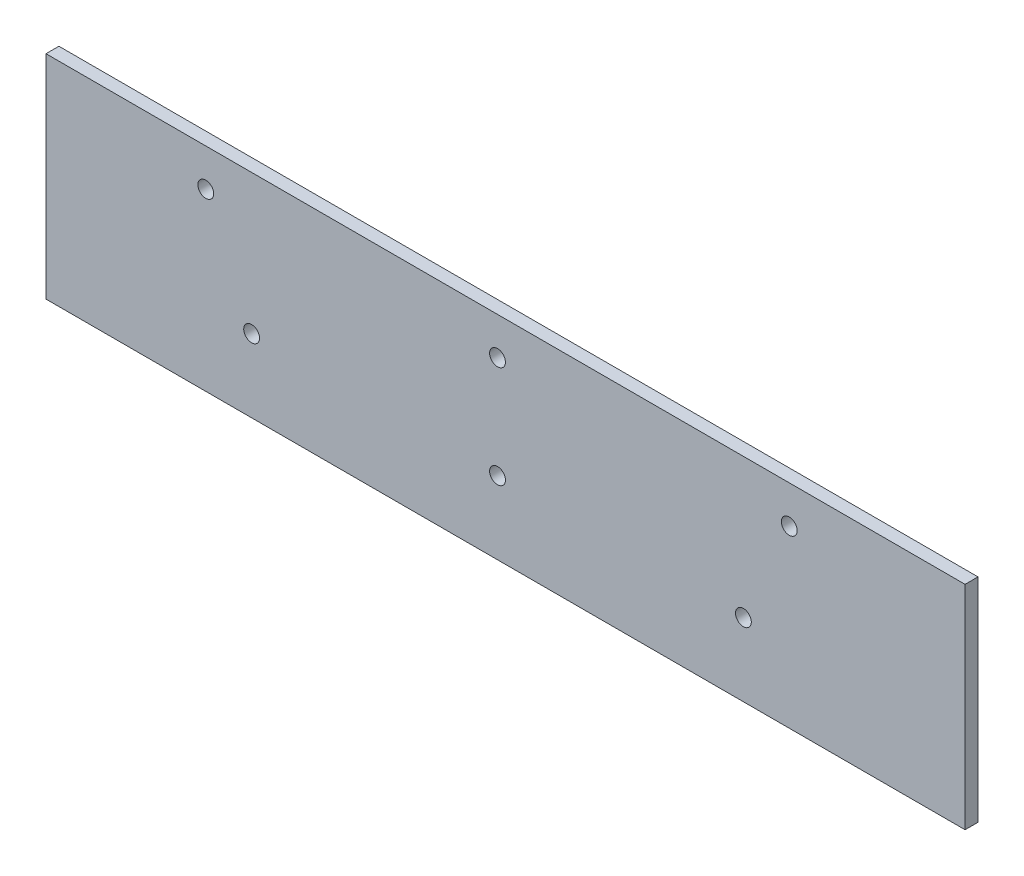
ISO-10303-21;
HEADER;
FILE_DESCRIPTION(('STEP AP214'),'2;1');
FILE_NAME('part.step','',(''),(''),'','','');
FILE_SCHEMA(('AUTOMOTIVE_DESIGN { 1 0 10303 214 1 1 1 1 }'));
ENDSEC;
DATA;
#1=APPLICATION_CONTEXT('core data for automotive mechanical design processes');
#2=APPLICATION_PROTOCOL_DEFINITION('international standard','automotive_design',2000,#1);
#3=PRODUCT_CONTEXT('',#1,'mechanical');
#4=PRODUCT('Part','Part','',(#3));
#5=PRODUCT_RELATED_PRODUCT_CATEGORY('part','',(#4));
#6=PRODUCT_DEFINITION_FORMATION('','',#4);
#7=PRODUCT_DEFINITION_CONTEXT('part definition',#1,'design');
#8=PRODUCT_DEFINITION('design','',#6,#7);
#9=PRODUCT_DEFINITION_SHAPE('','',#8);
#10=(LENGTH_UNIT() NAMED_UNIT(*) SI_UNIT(.MILLI.,.METRE.));
#11=(NAMED_UNIT(*) PLANE_ANGLE_UNIT() SI_UNIT($,.RADIAN.));
#12=(NAMED_UNIT(*) SI_UNIT($,.STERADIAN.) SOLID_ANGLE_UNIT());
#13=UNCERTAINTY_MEASURE_WITH_UNIT(LENGTH_MEASURE(1.E-05),#10,'distance_accuracy_value','');
#14=(GEOMETRIC_REPRESENTATION_CONTEXT(3) GLOBAL_UNCERTAINTY_ASSIGNED_CONTEXT((#13)) GLOBAL_UNIT_ASSIGNED_CONTEXT((#10,
#11,#12)) REPRESENTATION_CONTEXT('',''));
#15=CARTESIAN_POINT('',(0.,0.,0.));
#16=DIRECTION('',(0.,0.,1.));
#17=DIRECTION('',(1.,0.,0.));
#18=AXIS2_PLACEMENT_3D('',#15,#16,#17);
#19=CARTESIAN_POINT('',(110.26625,-25.5,3.1));
#20=DIRECTION('',(-1.,0.,0.));
#21=DIRECTION('',(0.,0.,1.));
#22=AXIS2_PLACEMENT_3D('',#19,#20,#21);
#23=PLANE('',#22);
#24=DIRECTION('',(0.,1.,0.));
#25=VECTOR('',#24,1.);
#26=CARTESIAN_POINT('',(110.26625,-25.5,0.));
#27=LINE('',#26,#25);
#28=CARTESIAN_POINT('',(110.26625,-25.5,0.));
#29=VERTEX_POINT('',#28);
#30=CARTESIAN_POINT('',(110.26625,25.5,0.));
#31=VERTEX_POINT('',#30);
#32=EDGE_CURVE('E104',#29,#31,#27,.T.);
#33=ORIENTED_EDGE('',*,*,#32,.T.);
#34=DIRECTION('',(0.,0.,-1.));
#35=VECTOR('',#34,1.);
#36=CARTESIAN_POINT('',(110.26625,25.5,3.1));
#37=LINE('',#36,#35);
#38=CARTESIAN_POINT('',(110.26625,25.5,3.1));
#39=VERTEX_POINT('',#38);
#40=EDGE_CURVE('E11',#39,#31,#37,.T.);
#41=ORIENTED_EDGE('',*,*,#40,.F.);
#42=DIRECTION('',(0.,1.,0.));
#43=VECTOR('',#42,1.);
#44=CARTESIAN_POINT('',(110.26625,-25.5,3.1));
#45=LINE('',#44,#43);
#46=CARTESIAN_POINT('',(110.26625,-25.5,3.1));
#47=VERTEX_POINT('',#46);
#48=EDGE_CURVE('E92',#47,#39,#45,.T.);
#49=ORIENTED_EDGE('',*,*,#48,.F.);
#50=DIRECTION('',(0.,0.,-1.));
#51=VECTOR('',#50,1.);
#52=CARTESIAN_POINT('',(110.26625,-25.5,3.1));
#53=LINE('',#52,#51);
#54=EDGE_CURVE('E100',#47,#29,#53,.T.);
#55=ORIENTED_EDGE('',*,*,#54,.T.);
#56=EDGE_LOOP('',(#33,#41,#49,#55));
#57=FACE_BOUND('',#56,.T.);
#58=ADVANCED_FACE('F41',(#57),#23,.F.);
#59=CARTESIAN_POINT('',(-110.26625,25.5,3.1));
#60=DIRECTION('',(0.,-1.,0.));
#61=DIRECTION('',(0.,0.,-1.));
#62=AXIS2_PLACEMENT_3D('',#59,#60,#61);
#63=PLANE('',#62);
#64=DIRECTION('',(-1.,0.,0.));
#65=VECTOR('',#64,1.);
#66=CARTESIAN_POINT('',(-110.26625,25.5,0.));
#67=LINE('',#66,#65);
#68=CARTESIAN_POINT('',(-110.26625,25.5,0.));
#69=VERTEX_POINT('',#68);
#70=EDGE_CURVE('E96',#31,#69,#67,.T.);
#71=ORIENTED_EDGE('',*,*,#70,.T.);
#72=DIRECTION('',(0.,0.,-1.));
#73=VECTOR('',#72,1.);
#74=CARTESIAN_POINT('',(-110.26625,25.5,3.1));
#75=LINE('',#74,#73);
#76=CARTESIAN_POINT('',(-110.26625,25.5,3.1));
#77=VERTEX_POINT('',#76);
#78=EDGE_CURVE('E49',#77,#69,#75,.T.);
#79=ORIENTED_EDGE('',*,*,#78,.F.);
#80=DIRECTION('',(-1.,0.,0.));
#81=VECTOR('',#80,1.);
#82=CARTESIAN_POINT('',(-110.26625,25.5,3.1));
#83=LINE('',#82,#81);
#84=EDGE_CURVE('E87',#39,#77,#83,.T.);
#85=ORIENTED_EDGE('',*,*,#84,.F.);
#86=ORIENTED_EDGE('',*,*,#40,.T.);
#87=EDGE_LOOP('',(#71,#79,#85,#86));
#88=FACE_BOUND('',#87,.T.);
#89=ADVANCED_FACE('F95',(#88),#63,.F.);
#90=CARTESIAN_POINT('',(-110.26625,-25.5,3.1));
#91=DIRECTION('',(1.,0.,0.));
#92=DIRECTION('',(0.,0.,-1.));
#93=AXIS2_PLACEMENT_3D('',#90,#91,#92);
#94=PLANE('',#93);
#95=DIRECTION('',(0.,-1.,0.));
#96=VECTOR('',#95,1.);
#97=CARTESIAN_POINT('',(-110.26625,-25.5,0.));
#98=LINE('',#97,#96);
#99=CARTESIAN_POINT('',(-110.26625,-25.5,0.));
#100=VERTEX_POINT('',#99);
#101=EDGE_CURVE('E74',#69,#100,#98,.T.);
#102=ORIENTED_EDGE('',*,*,#101,.T.);
#103=DIRECTION('',(0.,0.,-1.));
#104=VECTOR('',#103,1.);
#105=CARTESIAN_POINT('',(-110.26625,-25.5,3.1));
#106=LINE('',#105,#104);
#107=CARTESIAN_POINT('',(-110.26625,-25.5,3.1));
#108=VERTEX_POINT('',#107);
#109=EDGE_CURVE('E97',#108,#100,#106,.T.);
#110=ORIENTED_EDGE('',*,*,#109,.F.);
#111=DIRECTION('',(0.,-1.,0.));
#112=VECTOR('',#111,1.);
#113=CARTESIAN_POINT('',(-110.26625,-25.5,3.1));
#114=LINE('',#113,#112);
#115=EDGE_CURVE('E90',#77,#108,#114,.T.);
#116=ORIENTED_EDGE('',*,*,#115,.F.);
#117=ORIENTED_EDGE('',*,*,#78,.T.);
#118=EDGE_LOOP('',(#102,#110,#116,#117));
#119=FACE_BOUND('',#118,.T.);
#120=ADVANCED_FACE('F98',(#119),#94,.F.);
#121=CARTESIAN_POINT('',(-110.26625,-25.5,3.1));
#122=DIRECTION('',(0.,1.,0.));
#123=DIRECTION('',(0.,0.,1.));
#124=AXIS2_PLACEMENT_3D('',#121,#122,#123);
#125=PLANE('',#124);
#126=DIRECTION('',(1.,0.,0.));
#127=VECTOR('',#126,1.);
#128=CARTESIAN_POINT('',(-110.26625,-25.5,0.));
#129=LINE('',#128,#127);
#130=EDGE_CURVE('E80',#100,#29,#129,.T.);
#131=ORIENTED_EDGE('',*,*,#130,.T.);
#132=ORIENTED_EDGE('',*,*,#54,.F.);
#133=DIRECTION('',(1.,0.,0.));
#134=VECTOR('',#133,1.);
#135=CARTESIAN_POINT('',(-110.26625,-25.5,3.1));
#136=LINE('',#135,#134);
#137=EDGE_CURVE('E57',#108,#47,#136,.T.);
#138=ORIENTED_EDGE('',*,*,#137,.F.);
#139=ORIENTED_EDGE('',*,*,#109,.T.);
#140=EDGE_LOOP('',(#131,#132,#138,#139));
#141=FACE_BOUND('',#140,.T.);
#142=ADVANCED_FACE('F112',(#141),#125,.F.);
#143=CARTESIAN_POINT('',(0.,0.,3.1));
#144=DIRECTION('',(0.,0.,-1.));
#145=DIRECTION('',(-1.,0.,0.));
#146=AXIS2_PLACEMENT_3D('',#143,#144,#145);
#147=PLANE('',#146);
#148=CARTESIAN_POINT('',(-71.925,16.5,3.1));
#149=DIRECTION('',(0.,0.,1.));
#150=DIRECTION('',(1.,0.,0.));
#151=AXIS2_PLACEMENT_3D('',#148,#149,#150);
#152=CIRCLE('',#151,1.89865);
#153=CARTESIAN_POINT('',(-70.02635,16.5,3.1));
#154=VERTEX_POINT('',#153);
#155=EDGE_CURVE('E150',#154,#154,#152,.T.);
#156=ORIENTED_EDGE('',*,*,#155,.F.);
#157=EDGE_LOOP('',(#156));
#158=FACE_BOUND('',#157,.T.);
#159=CARTESIAN_POINT('',(-60.925,-8.00000000000197,3.1));
#160=DIRECTION('',(0.,0.,1.));
#161=DIRECTION('',(1.,0.,0.));
#162=AXIS2_PLACEMENT_3D('',#159,#160,#161);
#163=CIRCLE('',#162,1.89865);
#164=CARTESIAN_POINT('',(-59.02635,-8.00000000000197,3.1));
#165=VERTEX_POINT('',#164);
#166=EDGE_CURVE('E144',#165,#165,#163,.T.);
#167=ORIENTED_EDGE('',*,*,#166,.F.);
#168=EDGE_LOOP('',(#167));
#169=FACE_BOUND('',#168,.T.);
#170=CARTESIAN_POINT('',(-1.92500000000001,-8.00000000000196,3.1));
#171=DIRECTION('',(0.,0.,1.));
#172=DIRECTION('',(1.,0.,0.));
#173=AXIS2_PLACEMENT_3D('',#170,#171,#172);
#174=CIRCLE('',#173,1.89865);
#175=CARTESIAN_POINT('',(-0.0263500000000105,-8.00000000000196,3.1));
#176=VERTEX_POINT('',#175);
#177=EDGE_CURVE('E138',#176,#176,#174,.T.);
#178=ORIENTED_EDGE('',*,*,#177,.F.);
#179=EDGE_LOOP('',(#178));
#180=FACE_BOUND('',#179,.T.);
#181=CARTESIAN_POINT('',(-1.925,16.5,3.1));
#182=DIRECTION('',(0.,0.,1.));
#183=DIRECTION('',(1.,0.,0.));
#184=AXIS2_PLACEMENT_3D('',#181,#182,#183);
#185=CIRCLE('',#184,1.89865);
#186=CARTESIAN_POINT('',(-0.0263499999999966,16.5,3.1));
#187=VERTEX_POINT('',#186);
#188=EDGE_CURVE('E132',#187,#187,#185,.T.);
#189=ORIENTED_EDGE('',*,*,#188,.F.);
#190=EDGE_LOOP('',(#189));
#191=FACE_BOUND('',#190,.T.);
#192=CARTESIAN_POINT('',(68.075,16.5,3.1));
#193=DIRECTION('',(0.,0.,1.));
#194=DIRECTION('',(1.,0.,0.));
#195=AXIS2_PLACEMENT_3D('',#192,#193,#194);
#196=CIRCLE('',#195,1.89865);
#197=CARTESIAN_POINT('',(69.97365,16.5,3.1));
#198=VERTEX_POINT('',#197);
#199=EDGE_CURVE('E126',#198,#198,#196,.T.);
#200=ORIENTED_EDGE('',*,*,#199,.F.);
#201=EDGE_LOOP('',(#200));
#202=FACE_BOUND('',#201,.T.);
#203=CARTESIAN_POINT('',(57.075,-8.00000000000196,3.1));
#204=DIRECTION('',(0.,0.,1.));
#205=DIRECTION('',(1.,0.,0.));
#206=AXIS2_PLACEMENT_3D('',#203,#204,#205);
#207=CIRCLE('',#206,1.89865);
#208=CARTESIAN_POINT('',(58.97365,-8.00000000000196,3.1));
#209=VERTEX_POINT('',#208);
#210=EDGE_CURVE('E120',#209,#209,#207,.T.);
#211=ORIENTED_EDGE('',*,*,#210,.F.);
#212=EDGE_LOOP('',(#211));
#213=FACE_BOUND('',#212,.T.);
#214=ORIENTED_EDGE('',*,*,#48,.T.);
#215=ORIENTED_EDGE('',*,*,#84,.T.);
#216=ORIENTED_EDGE('',*,*,#115,.T.);
#217=ORIENTED_EDGE('',*,*,#137,.T.);
#218=EDGE_LOOP('',(#214,#215,#216,#217));
#219=FACE_BOUND('',#218,.T.);
#220=ADVANCED_FACE('F88',(#158,#169,#180,#191,#202,#213,#219),#147,.F.);
#221=CARTESIAN_POINT('',(0.,0.,0.));
#222=DIRECTION('',(0.,0.,-1.));
#223=DIRECTION('',(-1.,0.,0.));
#224=AXIS2_PLACEMENT_3D('',#221,#222,#223);
#225=PLANE('',#224);
#226=CARTESIAN_POINT('',(-71.925,16.5,0.));
#227=DIRECTION('',(0.,0.,1.));
#228=DIRECTION('',(1.,0.,0.));
#229=AXIS2_PLACEMENT_3D('',#226,#227,#228);
#230=CIRCLE('',#229,1.89865);
#231=CARTESIAN_POINT('',(-70.02635,16.5,0.));
#232=VERTEX_POINT('',#231);
#233=EDGE_CURVE('E147',#232,#232,#230,.T.);
#234=ORIENTED_EDGE('',*,*,#233,.T.);
#235=EDGE_LOOP('',(#234));
#236=FACE_BOUND('',#235,.T.);
#237=CARTESIAN_POINT('',(-60.925,-8.00000000000197,0.));
#238=DIRECTION('',(0.,0.,1.));
#239=DIRECTION('',(1.,0.,0.));
#240=AXIS2_PLACEMENT_3D('',#237,#238,#239);
#241=CIRCLE('',#240,1.89865);
#242=CARTESIAN_POINT('',(-59.02635,-8.00000000000197,0.));
#243=VERTEX_POINT('',#242);
#244=EDGE_CURVE('E141',#243,#243,#241,.T.);
#245=ORIENTED_EDGE('',*,*,#244,.T.);
#246=EDGE_LOOP('',(#245));
#247=FACE_BOUND('',#246,.T.);
#248=CARTESIAN_POINT('',(-1.92500000000001,-8.00000000000196,0.));
#249=DIRECTION('',(0.,0.,1.));
#250=DIRECTION('',(1.,0.,0.));
#251=AXIS2_PLACEMENT_3D('',#248,#249,#250);
#252=CIRCLE('',#251,1.89865);
#253=CARTESIAN_POINT('',(-0.0263500000000111,-8.00000000000196,0.));
#254=VERTEX_POINT('',#253);
#255=EDGE_CURVE('E135',#254,#254,#252,.T.);
#256=ORIENTED_EDGE('',*,*,#255,.T.);
#257=EDGE_LOOP('',(#256));
#258=FACE_BOUND('',#257,.T.);
#259=CARTESIAN_POINT('',(-1.925,16.5,0.));
#260=DIRECTION('',(0.,0.,1.));
#261=DIRECTION('',(1.,0.,0.));
#262=AXIS2_PLACEMENT_3D('',#259,#260,#261);
#263=CIRCLE('',#262,1.89865);
#264=CARTESIAN_POINT('',(-0.0263499999999973,16.5,0.));
#265=VERTEX_POINT('',#264);
#266=EDGE_CURVE('E129',#265,#265,#263,.T.);
#267=ORIENTED_EDGE('',*,*,#266,.T.);
#268=EDGE_LOOP('',(#267));
#269=FACE_BOUND('',#268,.T.);
#270=CARTESIAN_POINT('',(68.075,16.5,0.));
#271=DIRECTION('',(0.,0.,1.));
#272=DIRECTION('',(1.,0.,0.));
#273=AXIS2_PLACEMENT_3D('',#270,#271,#272);
#274=CIRCLE('',#273,1.89865);
#275=CARTESIAN_POINT('',(69.97365,16.5,0.));
#276=VERTEX_POINT('',#275);
#277=EDGE_CURVE('E123',#276,#276,#274,.T.);
#278=ORIENTED_EDGE('',*,*,#277,.T.);
#279=EDGE_LOOP('',(#278));
#280=FACE_BOUND('',#279,.T.);
#281=CARTESIAN_POINT('',(57.075,-8.00000000000196,0.));
#282=DIRECTION('',(0.,0.,1.));
#283=DIRECTION('',(1.,0.,0.));
#284=AXIS2_PLACEMENT_3D('',#281,#282,#283);
#285=CIRCLE('',#284,1.89865);
#286=CARTESIAN_POINT('',(58.97365,-8.00000000000196,0.));
#287=VERTEX_POINT('',#286);
#288=EDGE_CURVE('E107',#287,#287,#285,.T.);
#289=ORIENTED_EDGE('',*,*,#288,.T.);
#290=EDGE_LOOP('',(#289));
#291=FACE_BOUND('',#290,.T.);
#292=ORIENTED_EDGE('',*,*,#32,.F.);
#293=ORIENTED_EDGE('',*,*,#130,.F.);
#294=ORIENTED_EDGE('',*,*,#101,.F.);
#295=ORIENTED_EDGE('',*,*,#70,.F.);
#296=EDGE_LOOP('',(#292,#293,#294,#295));
#297=FACE_BOUND('',#296,.T.);
#298=ADVANCED_FACE('F115',(#236,#247,#258,#269,#280,#291,#297),#225,.T.);
#299=CARTESIAN_POINT('',(57.075,-8.00000000000196,3.1));
#300=DIRECTION('',(0.,0.,1.));
#301=DIRECTION('',(1.,0.,0.));
#302=AXIS2_PLACEMENT_3D('',#299,#300,#301);
#303=CYLINDRICAL_SURFACE('',#302,1.89865);
#304=ORIENTED_EDGE('',*,*,#288,.F.);
#305=EDGE_LOOP('',(#304));
#306=FACE_BOUND('',#305,.T.);
#307=ORIENTED_EDGE('',*,*,#210,.T.);
#308=EDGE_LOOP('',(#307));
#309=FACE_BOUND('',#308,.T.);
#310=ADVANCED_FACE('F169',(#306,#309),#303,.F.);
#311=CARTESIAN_POINT('',(68.075,16.5,3.1));
#312=DIRECTION('',(0.,0.,1.));
#313=DIRECTION('',(1.,0.,0.));
#314=AXIS2_PLACEMENT_3D('',#311,#312,#313);
#315=CYLINDRICAL_SURFACE('',#314,1.89865);
#316=ORIENTED_EDGE('',*,*,#277,.F.);
#317=EDGE_LOOP('',(#316));
#318=FACE_BOUND('',#317,.T.);
#319=ORIENTED_EDGE('',*,*,#199,.T.);
#320=EDGE_LOOP('',(#319));
#321=FACE_BOUND('',#320,.T.);
#322=ADVANCED_FACE('F171',(#318,#321),#315,.F.);
#323=CARTESIAN_POINT('',(-1.925,16.5,3.1));
#324=DIRECTION('',(0.,0.,1.));
#325=DIRECTION('',(1.,0.,0.));
#326=AXIS2_PLACEMENT_3D('',#323,#324,#325);
#327=CYLINDRICAL_SURFACE('',#326,1.89865);
#328=ORIENTED_EDGE('',*,*,#266,.F.);
#329=EDGE_LOOP('',(#328));
#330=FACE_BOUND('',#329,.T.);
#331=ORIENTED_EDGE('',*,*,#188,.T.);
#332=EDGE_LOOP('',(#331));
#333=FACE_BOUND('',#332,.T.);
#334=ADVANCED_FACE('F178',(#330,#333),#327,.F.);
#335=CARTESIAN_POINT('',(-1.92500000000001,-8.00000000000196,3.1));
#336=DIRECTION('',(0.,0.,1.));
#337=DIRECTION('',(1.,0.,0.));
#338=AXIS2_PLACEMENT_3D('',#335,#336,#337);
#339=CYLINDRICAL_SURFACE('',#338,1.89865);
#340=ORIENTED_EDGE('',*,*,#255,.F.);
#341=EDGE_LOOP('',(#340));
#342=FACE_BOUND('',#341,.T.);
#343=ORIENTED_EDGE('',*,*,#177,.T.);
#344=EDGE_LOOP('',(#343));
#345=FACE_BOUND('',#344,.T.);
#346=ADVANCED_FACE('F227',(#342,#345),#339,.F.);
#347=CARTESIAN_POINT('',(-60.925,-8.00000000000197,3.1));
#348=DIRECTION('',(0.,0.,1.));
#349=DIRECTION('',(1.,0.,0.));
#350=AXIS2_PLACEMENT_3D('',#347,#348,#349);
#351=CYLINDRICAL_SURFACE('',#350,1.89865);
#352=ORIENTED_EDGE('',*,*,#244,.F.);
#353=EDGE_LOOP('',(#352));
#354=FACE_BOUND('',#353,.T.);
#355=ORIENTED_EDGE('',*,*,#166,.T.);
#356=EDGE_LOOP('',(#355));
#357=FACE_BOUND('',#356,.T.);
#358=ADVANCED_FACE('F237',(#354,#357),#351,.F.);
#359=CARTESIAN_POINT('',(-71.925,16.5,3.1));
#360=DIRECTION('',(0.,0.,1.));
#361=DIRECTION('',(1.,0.,0.));
#362=AXIS2_PLACEMENT_3D('',#359,#360,#361);
#363=CYLINDRICAL_SURFACE('',#362,1.89865);
#364=ORIENTED_EDGE('',*,*,#233,.F.);
#365=EDGE_LOOP('',(#364));
#366=FACE_BOUND('',#365,.T.);
#367=ORIENTED_EDGE('',*,*,#155,.T.);
#368=EDGE_LOOP('',(#367));
#369=FACE_BOUND('',#368,.T.);
#370=ADVANCED_FACE('F154',(#366,#369),#363,.F.);
#371=CLOSED_SHELL('',(#58,#89,#120,#142,#220,#298,#310,#322,#334,#346,#358,#370));
#372=MANIFOLD_SOLID_BREP('B2',#371);
#373=ADVANCED_BREP_SHAPE_REPRESENTATION('',(#18,#372),#14);
#374=SHAPE_DEFINITION_REPRESENTATION(#9,#373);
ENDSEC;
END-ISO-10303-21;
